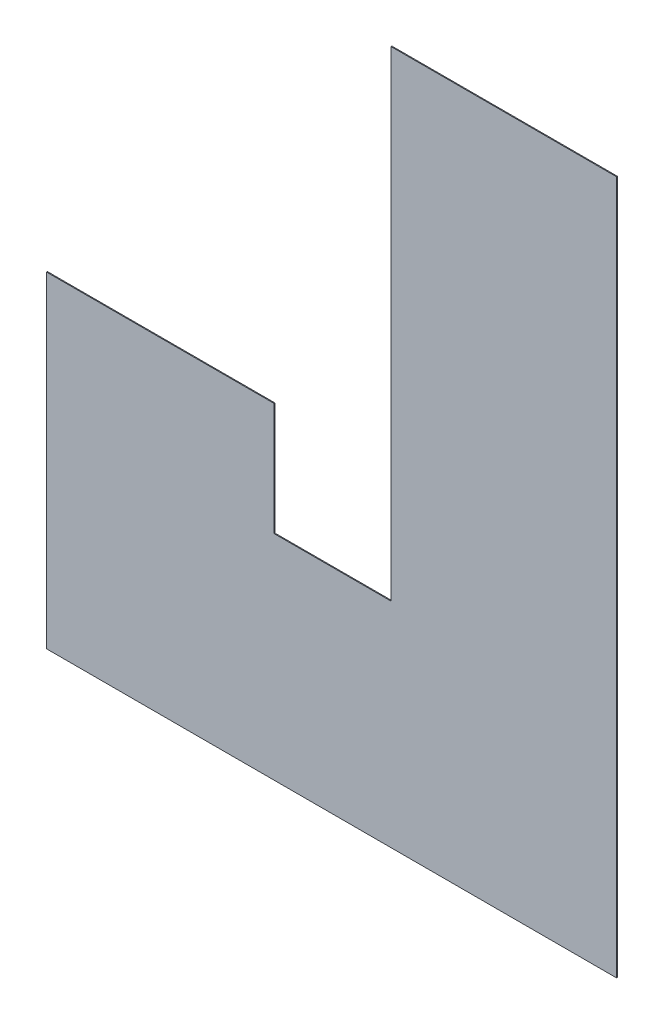
ISO-10303-21;
HEADER;
FILE_DESCRIPTION(('STEP AP214'),'2;1');
FILE_NAME('part.step','',(''),(''),'','','');
FILE_SCHEMA(('AUTOMOTIVE_DESIGN { 1 0 10303 214 1 1 1 1 }'));
ENDSEC;
DATA;
#1=APPLICATION_CONTEXT('core data for automotive mechanical design processes');
#2=APPLICATION_PROTOCOL_DEFINITION('international standard','automotive_design',2000,#1);
#3=PRODUCT_CONTEXT('',#1,'mechanical');
#4=PRODUCT('Part','Part','',(#3));
#5=PRODUCT_RELATED_PRODUCT_CATEGORY('part','',(#4));
#6=PRODUCT_DEFINITION_FORMATION('','',#4);
#7=PRODUCT_DEFINITION_CONTEXT('part definition',#1,'design');
#8=PRODUCT_DEFINITION('design','',#6,#7);
#9=PRODUCT_DEFINITION_SHAPE('','',#8);
#10=(LENGTH_UNIT() NAMED_UNIT(*) SI_UNIT(.MILLI.,.METRE.));
#11=(NAMED_UNIT(*) PLANE_ANGLE_UNIT() SI_UNIT($,.RADIAN.));
#12=(NAMED_UNIT(*) SI_UNIT($,.STERADIAN.) SOLID_ANGLE_UNIT());
#13=UNCERTAINTY_MEASURE_WITH_UNIT(LENGTH_MEASURE(1.E-05),#10,'distance_accuracy_value','');
#14=(GEOMETRIC_REPRESENTATION_CONTEXT(3) GLOBAL_UNCERTAINTY_ASSIGNED_CONTEXT((#13)) GLOBAL_UNIT_ASSIGNED_CONTEXT((#10,
#11,#12)) REPRESENTATION_CONTEXT('',''));
#15=CARTESIAN_POINT('',(0.,0.,0.));
#16=DIRECTION('',(0.,0.,1.));
#17=DIRECTION('',(1.,0.,0.));
#18=AXIS2_PLACEMENT_3D('',#15,#16,#17);
#19=CARTESIAN_POINT('',(3.86022808588961E-13,3307.48136658604,40655.2208429727));
#20=DIRECTION('',(0.,-1.,0.));
#21=DIRECTION('',(1.,0.,0.));
#22=AXIS2_PLACEMENT_3D('',#19,#20,#21);
#23=PLANE('',#22);
#24=DIRECTION('',(-1.,0.,0.));
#25=VECTOR('',#24,1.);
#26=CARTESIAN_POINT('',(3.86022808588961E-13,3307.48136658604,40625.2208429727));
#27=LINE('',#26,#25);
#28=CARTESIAN_POINT('',(-7996.61768329129,3307.48136658604,40625.2208429727));
#29=VERTEX_POINT('',#28);
#30=CARTESIAN_POINT('',(-15606.6176832913,3307.48136658604,40625.2208429727));
#31=VERTEX_POINT('',#30);
#32=EDGE_CURVE('E136',#29,#31,#27,.T.);
#33=ORIENTED_EDGE('',*,*,#32,.T.);
#34=DIRECTION('',(0.,0.,-1.));
#35=VECTOR('',#34,1.);
#36=CARTESIAN_POINT('',(-15606.6176832913,3307.48136658604,40655.2208429727));
#37=LINE('',#36,#35);
#38=CARTESIAN_POINT('',(-15606.6176832913,3307.48136658604,40655.2208429727));
#39=VERTEX_POINT('',#38);
#40=EDGE_CURVE('E11',#39,#31,#37,.T.);
#41=ORIENTED_EDGE('',*,*,#40,.F.);
#42=DIRECTION('',(-1.,0.,0.));
#43=VECTOR('',#42,1.);
#44=CARTESIAN_POINT('',(3.86022808588961E-13,3307.48136658604,40655.2208429727));
#45=LINE('',#44,#43);
#46=CARTESIAN_POINT('',(-7996.61768329129,3307.48136658604,40655.2208429727));
#47=VERTEX_POINT('',#46);
#48=EDGE_CURVE('E155',#47,#39,#45,.T.);
#49=ORIENTED_EDGE('',*,*,#48,.F.);
#50=DIRECTION('',(0.,0.,-1.));
#51=VECTOR('',#50,1.);
#52=CARTESIAN_POINT('',(-7996.61768329129,3307.48136658604,40655.2208429727));
#53=LINE('',#52,#51);
#54=EDGE_CURVE('E55',#47,#29,#53,.T.);
#55=ORIENTED_EDGE('',*,*,#54,.T.);
#56=EDGE_LOOP('',(#33,#41,#49,#55));
#57=FACE_BOUND('',#56,.T.);
#58=ADVANCED_FACE('F39',(#57),#23,.F.);
#59=CARTESIAN_POINT('',(-15606.6176832913,-2.37049354951854E-12,40655.2208429727));
#60=DIRECTION('',(1.,0.,0.));
#61=DIRECTION('',(0.,1.,0.));
#62=AXIS2_PLACEMENT_3D('',#59,#60,#61);
#63=PLANE('',#62);
#64=DIRECTION('',(0.,-1.,0.));
#65=VECTOR('',#64,1.);
#66=CARTESIAN_POINT('',(-15606.6176832913,-2.37049354951854E-12,40625.2208429727));
#67=LINE('',#66,#65);
#68=CARTESIAN_POINT('',(-15606.6176832913,-12882.518633414,40625.2208429727));
#69=VERTEX_POINT('',#68);
#70=EDGE_CURVE('E138',#31,#69,#67,.T.);
#71=ORIENTED_EDGE('',*,*,#70,.T.);
#72=DIRECTION('',(0.,0.,-1.));
#73=VECTOR('',#72,1.);
#74=CARTESIAN_POINT('',(-15606.6176832913,-12882.518633414,40655.2208429727));
#75=LINE('',#74,#73);
#76=CARTESIAN_POINT('',(-15606.6176832913,-12882.518633414,40655.2208429727));
#77=VERTEX_POINT('',#76);
#78=EDGE_CURVE('E47',#77,#69,#75,.T.);
#79=ORIENTED_EDGE('',*,*,#78,.F.);
#80=DIRECTION('',(0.,-1.,0.));
#81=VECTOR('',#80,1.);
#82=CARTESIAN_POINT('',(-15606.6176832913,-2.37049354951854E-12,40655.2208429727));
#83=LINE('',#82,#81);
#84=EDGE_CURVE('E93',#39,#77,#83,.T.);
#85=ORIENTED_EDGE('',*,*,#84,.F.);
#86=ORIENTED_EDGE('',*,*,#40,.T.);
#87=EDGE_LOOP('',(#71,#79,#85,#86));
#88=FACE_BOUND('',#87,.T.);
#89=ADVANCED_FACE('F182',(#88),#63,.F.);
#90=CARTESIAN_POINT('',(1.97020663651882E-12,-12882.518633414,40655.2208429727));
#91=DIRECTION('',(0.,-1.,0.));
#92=DIRECTION('',(1.,0.,0.));
#93=AXIS2_PLACEMENT_3D('',#90,#91,#92);
#94=PLANE('',#93);
#95=DIRECTION('',(-1.,0.,0.));
#96=VECTOR('',#95,1.);
#97=CARTESIAN_POINT('',(1.97020663651882E-12,-12882.518633414,40625.2208429727));
#98=LINE('',#97,#96);
#99=CARTESIAN_POINT('',(-19546.6176832913,-12882.518633414,40625.2208429727));
#100=VERTEX_POINT('',#99);
#101=EDGE_CURVE('E140',#69,#100,#98,.T.);
#102=ORIENTED_EDGE('',*,*,#101,.T.);
#103=DIRECTION('',(0.,0.,-1.));
#104=VECTOR('',#103,1.);
#105=CARTESIAN_POINT('',(-19546.6176832913,-12882.518633414,40655.2208429727));
#106=LINE('',#105,#104);
#107=CARTESIAN_POINT('',(-19546.6176832913,-12882.518633414,40655.2208429727));
#108=VERTEX_POINT('',#107);
#109=EDGE_CURVE('E161',#108,#100,#106,.T.);
#110=ORIENTED_EDGE('',*,*,#109,.F.);
#111=DIRECTION('',(-1.,0.,0.));
#112=VECTOR('',#111,1.);
#113=CARTESIAN_POINT('',(1.97020663651882E-12,-12882.518633414,40655.2208429727));
#114=LINE('',#113,#112);
#115=EDGE_CURVE('E168',#77,#108,#114,.T.);
#116=ORIENTED_EDGE('',*,*,#115,.F.);
#117=ORIENTED_EDGE('',*,*,#78,.T.);
#118=EDGE_LOOP('',(#102,#110,#116,#117));
#119=FACE_BOUND('',#118,.T.);
#120=ADVANCED_FACE('F166',(#119),#94,.F.);
#121=CARTESIAN_POINT('',(-19546.6176832913,0.,40655.2208429727));
#122=DIRECTION('',(1.,0.,0.));
#123=DIRECTION('',(0.,0.,-1.));
#124=AXIS2_PLACEMENT_3D('',#121,#122,#123);
#125=PLANE('',#124);
#126=DIRECTION('',(0.,-1.,0.));
#127=VECTOR('',#126,1.);
#128=CARTESIAN_POINT('',(-19546.6176832913,0.,40625.2208429727));
#129=LINE('',#128,#127);
#130=CARTESIAN_POINT('',(-19546.6176832913,-9082.51863341396,40625.2208429727));
#131=VERTEX_POINT('',#130);
#132=EDGE_CURVE('E143',#131,#100,#129,.T.);
#133=ORIENTED_EDGE('',*,*,#132,.F.);
#134=DIRECTION('',(0.,0.,-1.));
#135=VECTOR('',#134,1.);
#136=CARTESIAN_POINT('',(-19546.6176832913,-9082.51863341396,40655.2208429727));
#137=LINE('',#136,#135);
#138=CARTESIAN_POINT('',(-19546.6176832913,-9082.51863341396,40655.2208429727));
#139=VERTEX_POINT('',#138);
#140=EDGE_CURVE('E159',#139,#131,#137,.T.);
#141=ORIENTED_EDGE('',*,*,#140,.F.);
#142=DIRECTION('',(0.,-1.,0.));
#143=VECTOR('',#142,1.);
#144=CARTESIAN_POINT('',(-19546.6176832913,0.,40655.2208429727));
#145=LINE('',#144,#143);
#146=EDGE_CURVE('E176',#139,#108,#145,.T.);
#147=ORIENTED_EDGE('',*,*,#146,.T.);
#148=ORIENTED_EDGE('',*,*,#109,.T.);
#149=EDGE_LOOP('',(#133,#141,#147,#148));
#150=FACE_BOUND('',#149,.T.);
#151=ADVANCED_FACE('F174',(#150),#125,.T.);
#152=CARTESIAN_POINT('',(0.,-9082.51863341396,40655.2208429727));
#153=DIRECTION('',(0.,1.,0.));
#154=DIRECTION('',(0.,0.,1.));
#155=AXIS2_PLACEMENT_3D('',#152,#153,#154);
#156=PLANE('',#155);
#157=DIRECTION('',(1.,0.,0.));
#158=VECTOR('',#157,1.);
#159=CARTESIAN_POINT('',(0.,-9082.51863341396,40625.2208429727));
#160=LINE('',#159,#158);
#161=CARTESIAN_POINT('',(-27221.6176832913,-9082.51863341396,40625.2208429727));
#162=VERTEX_POINT('',#161);
#163=EDGE_CURVE('E146',#162,#131,#160,.T.);
#164=ORIENTED_EDGE('',*,*,#163,.F.);
#165=DIRECTION('',(0.,0.,-1.));
#166=VECTOR('',#165,1.);
#167=CARTESIAN_POINT('',(-27221.6176832913,-9082.51863341396,40655.2208429727));
#168=LINE('',#167,#166);
#169=CARTESIAN_POINT('',(-27221.6176832913,-9082.51863341396,40655.2208429727));
#170=VERTEX_POINT('',#169);
#171=EDGE_CURVE('E118',#170,#162,#168,.T.);
#172=ORIENTED_EDGE('',*,*,#171,.F.);
#173=DIRECTION('',(1.,0.,0.));
#174=VECTOR('',#173,1.);
#175=CARTESIAN_POINT('',(0.,-9082.51863341396,40655.2208429727));
#176=LINE('',#175,#174);
#177=EDGE_CURVE('E128',#170,#139,#176,.T.);
#178=ORIENTED_EDGE('',*,*,#177,.T.);
#179=ORIENTED_EDGE('',*,*,#140,.T.);
#180=EDGE_LOOP('',(#164,#172,#178,#179));
#181=FACE_BOUND('',#180,.T.);
#182=ADVANCED_FACE('F192',(#181),#156,.T.);
#183=CARTESIAN_POINT('',(-27221.6176832913,0.,40655.2208429727));
#184=DIRECTION('',(-1.,0.,0.));
#185=DIRECTION('',(0.,0.,1.));
#186=AXIS2_PLACEMENT_3D('',#183,#184,#185);
#187=PLANE('',#186);
#188=DIRECTION('',(0.,1.,0.));
#189=VECTOR('',#188,1.);
#190=CARTESIAN_POINT('',(-27221.6176832913,0.,40625.2208429727));
#191=LINE('',#190,#189);
#192=CARTESIAN_POINT('',(-27221.6176832913,-20082.518633414,40625.2208429727));
#193=VERTEX_POINT('',#192);
#194=EDGE_CURVE('E114',#193,#162,#191,.T.);
#195=ORIENTED_EDGE('',*,*,#194,.F.);
#196=DIRECTION('',(0.,0.,-1.));
#197=VECTOR('',#196,1.);
#198=CARTESIAN_POINT('',(-27221.6176832913,-20082.518633414,40655.2208429727));
#199=LINE('',#198,#197);
#200=CARTESIAN_POINT('',(-27221.6176832913,-20082.518633414,40655.2208429727));
#201=VERTEX_POINT('',#200);
#202=EDGE_CURVE('E109',#201,#193,#199,.T.);
#203=ORIENTED_EDGE('',*,*,#202,.F.);
#204=DIRECTION('',(0.,1.,0.));
#205=VECTOR('',#204,1.);
#206=CARTESIAN_POINT('',(-27221.6176832913,0.,40655.2208429727));
#207=LINE('',#206,#205);
#208=EDGE_CURVE('E112',#201,#170,#207,.T.);
#209=ORIENTED_EDGE('',*,*,#208,.T.);
#210=ORIENTED_EDGE('',*,*,#171,.T.);
#211=EDGE_LOOP('',(#195,#203,#209,#210));
#212=FACE_BOUND('',#211,.T.);
#213=ADVANCED_FACE('F111',(#212),#187,.T.);
#214=CARTESIAN_POINT('',(0.,-20082.518633414,40655.2208429727));
#215=DIRECTION('',(0.,-1.,0.));
#216=DIRECTION('',(0.,0.,-1.));
#217=AXIS2_PLACEMENT_3D('',#214,#215,#216);
#218=PLANE('',#217);
#219=DIRECTION('',(-1.,0.,0.));
#220=VECTOR('',#219,1.);
#221=CARTESIAN_POINT('',(0.,-20082.518633414,40625.2208429727));
#222=LINE('',#221,#220);
#223=CARTESIAN_POINT('',(-7996.61768329129,-20082.518633414,40625.2208429727));
#224=VERTEX_POINT('',#223);
#225=EDGE_CURVE('E150',#224,#193,#222,.T.);
#226=ORIENTED_EDGE('',*,*,#225,.F.);
#227=DIRECTION('',(0.,0.,-1.));
#228=VECTOR('',#227,1.);
#229=CARTESIAN_POINT('',(-7996.61768329129,-20082.518633414,40655.2208429727));
#230=LINE('',#229,#228);
#231=CARTESIAN_POINT('',(-7996.61768329129,-20082.518633414,40655.2208429727));
#232=VERTEX_POINT('',#231);
#233=EDGE_CURVE('E81',#232,#224,#230,.T.);
#234=ORIENTED_EDGE('',*,*,#233,.F.);
#235=DIRECTION('',(-1.,0.,0.));
#236=VECTOR('',#235,1.);
#237=CARTESIAN_POINT('',(0.,-20082.518633414,40655.2208429727));
#238=LINE('',#237,#236);
#239=EDGE_CURVE('E125',#232,#201,#238,.T.);
#240=ORIENTED_EDGE('',*,*,#239,.T.);
#241=ORIENTED_EDGE('',*,*,#202,.T.);
#242=EDGE_LOOP('',(#226,#234,#240,#241));
#243=FACE_BOUND('',#242,.T.);
#244=ADVANCED_FACE('F130',(#243),#218,.T.);
#245=CARTESIAN_POINT('',(-7996.61768329129,-9.10956381815956E-13,40655.2208429727));
#246=DIRECTION('',(1.,0.,0.));
#247=DIRECTION('',(0.,1.,0.));
#248=AXIS2_PLACEMENT_3D('',#245,#246,#247);
#249=PLANE('',#248);
#250=DIRECTION('',(0.,-1.,0.));
#251=VECTOR('',#250,1.);
#252=CARTESIAN_POINT('',(-7996.61768329129,-9.10956381815956E-13,40625.2208429727));
#253=LINE('',#252,#251);
#254=EDGE_CURVE('E152',#29,#224,#253,.T.);
#255=ORIENTED_EDGE('',*,*,#254,.F.);
#256=ORIENTED_EDGE('',*,*,#54,.F.);
#257=DIRECTION('',(0.,-1.,0.));
#258=VECTOR('',#257,1.);
#259=CARTESIAN_POINT('',(-7996.61768329129,-9.10956381815956E-13,40655.2208429727));
#260=LINE('',#259,#258);
#261=EDGE_CURVE('E131',#47,#232,#260,.T.);
#262=ORIENTED_EDGE('',*,*,#261,.T.);
#263=ORIENTED_EDGE('',*,*,#233,.T.);
#264=EDGE_LOOP('',(#255,#256,#262,#263));
#265=FACE_BOUND('',#264,.T.);
#266=ADVANCED_FACE('F200',(#265),#249,.T.);
#267=CARTESIAN_POINT('',(0.,0.,40655.2208429727));
#268=DIRECTION('',(0.,0.,1.));
#269=DIRECTION('',(1.,0.,0.));
#270=AXIS2_PLACEMENT_3D('',#267,#268,#269);
#271=PLANE('',#270);
#272=ORIENTED_EDGE('',*,*,#48,.T.);
#273=ORIENTED_EDGE('',*,*,#84,.T.);
#274=ORIENTED_EDGE('',*,*,#115,.T.);
#275=ORIENTED_EDGE('',*,*,#146,.F.);
#276=ORIENTED_EDGE('',*,*,#177,.F.);
#277=ORIENTED_EDGE('',*,*,#208,.F.);
#278=ORIENTED_EDGE('',*,*,#239,.F.);
#279=ORIENTED_EDGE('',*,*,#261,.F.);
#280=EDGE_LOOP('',(#272,#273,#274,#275,#276,#277,#278,#279));
#281=FACE_BOUND('',#280,.T.);
#282=ADVANCED_FACE('F123',(#281),#271,.T.);
#283=CARTESIAN_POINT('',(0.,0.,40625.2208429727));
#284=DIRECTION('',(0.,0.,1.));
#285=DIRECTION('',(1.,0.,0.));
#286=AXIS2_PLACEMENT_3D('',#283,#284,#285);
#287=PLANE('',#286);
#288=ORIENTED_EDGE('',*,*,#32,.F.);
#289=ORIENTED_EDGE('',*,*,#254,.T.);
#290=ORIENTED_EDGE('',*,*,#225,.T.);
#291=ORIENTED_EDGE('',*,*,#194,.T.);
#292=ORIENTED_EDGE('',*,*,#163,.T.);
#293=ORIENTED_EDGE('',*,*,#132,.T.);
#294=ORIENTED_EDGE('',*,*,#101,.F.);
#295=ORIENTED_EDGE('',*,*,#70,.F.);
#296=EDGE_LOOP('',(#288,#289,#290,#291,#292,#293,#294,#295));
#297=FACE_BOUND('',#296,.T.);
#298=ADVANCED_FACE('F170',(#297),#287,.F.);
#299=CLOSED_SHELL('',(#58,#89,#120,#151,#182,#213,#244,#266,#282,#298));
#300=MANIFOLD_SOLID_BREP('B2',#299);
#301=ADVANCED_BREP_SHAPE_REPRESENTATION('',(#18,#300),#14);
#302=SHAPE_DEFINITION_REPRESENTATION(#9,#301);
ENDSEC;
END-ISO-10303-21;
